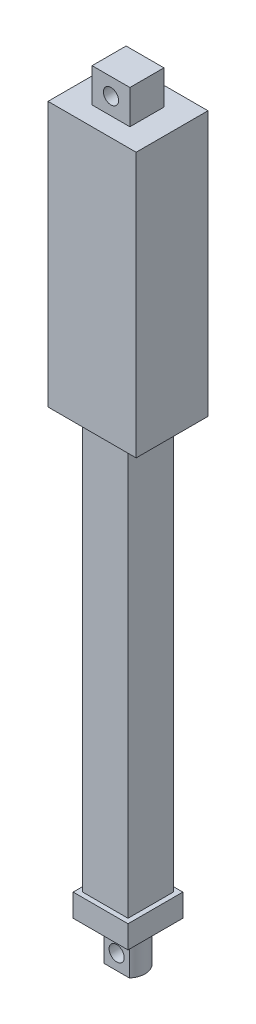
ISO-10303-21;
HEADER;
FILE_DESCRIPTION(('STEP AP214'),'2;1');
FILE_NAME('part.step','',(''),(''),'','','');
FILE_SCHEMA(('AUTOMOTIVE_DESIGN { 1 0 10303 214 1 1 1 1 }'));
ENDSEC;
DATA;
#1=APPLICATION_CONTEXT('core data for automotive mechanical design processes');
#2=APPLICATION_PROTOCOL_DEFINITION('international standard','automotive_design',2000,#1);
#3=PRODUCT_CONTEXT('',#1,'mechanical');
#4=PRODUCT('Part','Part','',(#3));
#5=PRODUCT_RELATED_PRODUCT_CATEGORY('part','',(#4));
#6=PRODUCT_DEFINITION_FORMATION('','',#4);
#7=PRODUCT_DEFINITION_CONTEXT('part definition',#1,'design');
#8=PRODUCT_DEFINITION('design','',#6,#7);
#9=PRODUCT_DEFINITION_SHAPE('','',#8);
#10=(LENGTH_UNIT() NAMED_UNIT(*) SI_UNIT(.MILLI.,.METRE.));
#11=(NAMED_UNIT(*) PLANE_ANGLE_UNIT() SI_UNIT($,.RADIAN.));
#12=(NAMED_UNIT(*) SI_UNIT($,.STERADIAN.) SOLID_ANGLE_UNIT());
#13=UNCERTAINTY_MEASURE_WITH_UNIT(LENGTH_MEASURE(1.E-05),#10,'distance_accuracy_value','');
#14=(GEOMETRIC_REPRESENTATION_CONTEXT(3) GLOBAL_UNCERTAINTY_ASSIGNED_CONTEXT((#13)) GLOBAL_UNIT_ASSIGNED_CONTEXT((#10,
#11,#12)) REPRESENTATION_CONTEXT('',''));
#15=CARTESIAN_POINT('',(0.,0.,0.));
#16=DIRECTION('',(0.,0.,1.));
#17=DIRECTION('',(1.,0.,0.));
#18=AXIS2_PLACEMENT_3D('',#15,#16,#17);
#19=CARTESIAN_POINT('',(0.,-126.5,0.));
#20=DIRECTION('',(0.,1.,0.));
#21=DIRECTION('',(0.,0.,1.));
#22=AXIS2_PLACEMENT_3D('',#19,#20,#21);
#23=CYLINDRICAL_SURFACE('',#22,4.5);
#24=CARTESIAN_POINT('',(0.,-126.5,0.));
#25=DIRECTION('',(0.,-1.,0.));
#26=DIRECTION('',(0.,0.,-1.));
#27=AXIS2_PLACEMENT_3D('',#24,#25,#26);
#28=CIRCLE('',#27,4.5);
#29=CARTESIAN_POINT('',(-3.35410196624968,-126.5,3.));
#30=VERTEX_POINT('',#29);
#31=CARTESIAN_POINT('',(-3.35410196624968,-126.5,-3.));
#32=VERTEX_POINT('',#31);
#33=EDGE_CURVE('E190',#30,#32,#28,.T.);
#34=ORIENTED_EDGE('',*,*,#33,.F.);
#35=DIRECTION('',(0.,-1.,0.));
#36=VECTOR('',#35,1.);
#37=CARTESIAN_POINT('',(-3.35410196624968,-109.126136457566,3.));
#38=LINE('',#37,#36);
#39=CARTESIAN_POINT('',(-3.35410196624968,-116.,3.));
#40=VERTEX_POINT('',#39);
#41=EDGE_CURVE('E51',#40,#30,#38,.T.);
#42=ORIENTED_EDGE('',*,*,#41,.F.);
#43=CARTESIAN_POINT('',(0.,-116.,0.));
#44=DIRECTION('',(0.,-1.,0.));
#45=DIRECTION('',(0.,0.,-1.));
#46=AXIS2_PLACEMENT_3D('',#43,#44,#45);
#47=CIRCLE('',#46,4.5);
#48=CARTESIAN_POINT('',(-3.35410196624968,-116.,-3.));
#49=VERTEX_POINT('',#48);
#50=EDGE_CURVE('E43',#40,#49,#47,.T.);
#51=ORIENTED_EDGE('',*,*,#50,.T.);
#52=DIRECTION('',(0.,-1.,0.));
#53=VECTOR('',#52,1.);
#54=CARTESIAN_POINT('',(-3.35410196624968,-109.126136457566,-3.));
#55=LINE('',#54,#53);
#56=EDGE_CURVE('E607',#49,#32,#55,.T.);
#57=ORIENTED_EDGE('',*,*,#56,.T.);
#58=EDGE_LOOP('',(#34,#42,#51,#57));
#59=FACE_BOUND('',#58,.T.);
#60=ADVANCED_FACE('F34',(#59),#23,.T.);
#61=CARTESIAN_POINT('',(3.35410196624968,-116.,-3.));
#62=VERTEX_POINT('',#61);
#63=CARTESIAN_POINT('',(3.35410196624968,-116.,3.));
#64=VERTEX_POINT('',#63);
#65=EDGE_CURVE('E11',#62,#64,#47,.T.);
#66=ORIENTED_EDGE('',*,*,#65,.T.);
#67=DIRECTION('',(0.,-1.,0.));
#68=VECTOR('',#67,1.);
#69=CARTESIAN_POINT('',(3.35410196624968,-109.126136457566,3.));
#70=LINE('',#69,#68);
#71=CARTESIAN_POINT('',(3.35410196624968,-126.5,3.));
#72=VERTEX_POINT('',#71);
#73=EDGE_CURVE('E173',#64,#72,#70,.T.);
#74=ORIENTED_EDGE('',*,*,#73,.T.);
#75=CARTESIAN_POINT('',(3.35410196624968,-126.5,-3.));
#76=VERTEX_POINT('',#75);
#77=EDGE_CURVE('E184',#76,#72,#28,.T.);
#78=ORIENTED_EDGE('',*,*,#77,.F.);
#79=DIRECTION('',(0.,-1.,0.));
#80=VECTOR('',#79,1.);
#81=CARTESIAN_POINT('',(3.35410196624968,-109.126136457566,-3.));
#82=LINE('',#81,#80);
#83=EDGE_CURVE('E59',#62,#76,#82,.T.);
#84=ORIENTED_EDGE('',*,*,#83,.F.);
#85=EDGE_LOOP('',(#66,#74,#78,#84));
#86=FACE_BOUND('',#85,.T.);
#87=ADVANCED_FACE('F183',(#86),#23,.T.);
#88=CARTESIAN_POINT('',(0.,-126.5,0.));
#89=DIRECTION('',(0.,-1.,0.));
#90=DIRECTION('',(0.,0.,-1.));
#91=AXIS2_PLACEMENT_3D('',#88,#89,#90);
#92=PLANE('',#91);
#93=DIRECTION('',(1.,0.,0.));
#94=VECTOR('',#93,1.);
#95=CARTESIAN_POINT('',(-3.35410196624968,-126.5,3.));
#96=LINE('',#95,#94);
#97=EDGE_CURVE('E170',#30,#72,#96,.T.);
#98=ORIENTED_EDGE('',*,*,#97,.F.);
#99=ORIENTED_EDGE('',*,*,#33,.T.);
#100=DIRECTION('',(1.,0.,0.));
#101=VECTOR('',#100,1.);
#102=CARTESIAN_POINT('',(-3.35410196624968,-126.5,-3.));
#103=LINE('',#102,#101);
#104=EDGE_CURVE('E179',#32,#76,#103,.T.);
#105=ORIENTED_EDGE('',*,*,#104,.T.);
#106=ORIENTED_EDGE('',*,*,#77,.T.);
#107=EDGE_LOOP('',(#98,#99,#105,#106));
#108=FACE_BOUND('',#107,.T.);
#109=ADVANCED_FACE('F188',(#108),#92,.T.);
#110=CARTESIAN_POINT('',(0.,0.,0.));
#111=DIRECTION('',(0.,1.,0.));
#112=DIRECTION('',(0.,0.,1.));
#113=AXIS2_PLACEMENT_3D('',#110,#111,#112);
#114=PLANE('',#113);
#115=DIRECTION('',(0.,0.,-1.));
#116=VECTOR('',#115,1.);
#117=CARTESIAN_POINT('',(11.65,0.,-9.5));
#118=LINE('',#117,#116);
#119=CARTESIAN_POINT('',(11.65,0.,9.5));
#120=VERTEX_POINT('',#119);
#121=CARTESIAN_POINT('',(11.65,0.,-9.5));
#122=VERTEX_POINT('',#121);
#123=EDGE_CURVE('E298',#120,#122,#118,.T.);
#124=ORIENTED_EDGE('',*,*,#123,.F.);
#125=DIRECTION('',(1.,0.,0.));
#126=VECTOR('',#125,1.);
#127=CARTESIAN_POINT('',(-11.65,0.,9.5));
#128=LINE('',#127,#126);
#129=CARTESIAN_POINT('',(-11.65,0.,9.5));
#130=VERTEX_POINT('',#129);
#131=EDGE_CURVE('E303',#130,#120,#128,.T.);
#132=ORIENTED_EDGE('',*,*,#131,.F.);
#133=DIRECTION('',(0.,0.,1.));
#134=VECTOR('',#133,1.);
#135=CARTESIAN_POINT('',(-11.65,0.,-9.5));
#136=LINE('',#135,#134);
#137=CARTESIAN_POINT('',(-11.65,0.,-9.5));
#138=VERTEX_POINT('',#137);
#139=EDGE_CURVE('E314',#138,#130,#136,.T.);
#140=ORIENTED_EDGE('',*,*,#139,.F.);
#141=DIRECTION('',(-1.,0.,0.));
#142=VECTOR('',#141,1.);
#143=CARTESIAN_POINT('',(-11.65,0.,-9.5));
#144=LINE('',#143,#142);
#145=EDGE_CURVE('E312',#122,#138,#144,.T.);
#146=ORIENTED_EDGE('',*,*,#145,.F.);
#147=EDGE_LOOP('',(#124,#132,#140,#146));
#148=FACE_BOUND('',#147,.T.);
#149=DIRECTION('',(0.,0.,1.));
#150=VECTOR('',#149,1.);
#151=CARTESIAN_POINT('',(6.,0.,6.));
#152=LINE('',#151,#150);
#153=CARTESIAN_POINT('',(6.,0.,-6.));
#154=VERTEX_POINT('',#153);
#155=CARTESIAN_POINT('',(6.,0.,6.));
#156=VERTEX_POINT('',#155);
#157=EDGE_CURVE('E225',#154,#156,#152,.T.);
#158=ORIENTED_EDGE('',*,*,#157,.F.);
#159=DIRECTION('',(1.,0.,0.));
#160=VECTOR('',#159,1.);
#161=CARTESIAN_POINT('',(-6.,0.,-6.));
#162=LINE('',#161,#160);
#163=CARTESIAN_POINT('',(-6.,0.,-6.));
#164=VERTEX_POINT('',#163);
#165=EDGE_CURVE('E230',#164,#154,#162,.T.);
#166=ORIENTED_EDGE('',*,*,#165,.F.);
#167=DIRECTION('',(0.,0.,-1.));
#168=VECTOR('',#167,1.);
#169=CARTESIAN_POINT('',(-6.,0.,6.));
#170=LINE('',#169,#168);
#171=CARTESIAN_POINT('',(-6.,0.,6.));
#172=VERTEX_POINT('',#171);
#173=EDGE_CURVE('E245',#172,#164,#170,.T.);
#174=ORIENTED_EDGE('',*,*,#173,.F.);
#175=DIRECTION('',(-1.,0.,0.));
#176=VECTOR('',#175,1.);
#177=CARTESIAN_POINT('',(-6.,0.,6.));
#178=LINE('',#177,#176);
#179=EDGE_CURVE('E242',#156,#172,#178,.T.);
#180=ORIENTED_EDGE('',*,*,#179,.F.);
#181=EDGE_LOOP('',(#158,#166,#174,#180));
#182=FACE_BOUND('',#181,.T.);
#183=ADVANCED_FACE('F421',(#148,#182),#114,.F.);
#184=CARTESIAN_POINT('',(11.65,70.,-9.5));
#185=DIRECTION('',(-1.,0.,0.));
#186=DIRECTION('',(0.,0.,1.));
#187=AXIS2_PLACEMENT_3D('',#184,#185,#186);
#188=PLANE('',#187);
#189=ORIENTED_EDGE('',*,*,#123,.T.);
#190=DIRECTION('',(0.,-1.,0.));
#191=VECTOR('',#190,1.);
#192=CARTESIAN_POINT('',(11.65,70.,-9.5));
#193=LINE('',#192,#191);
#194=CARTESIAN_POINT('',(11.65,70.,-9.5));
#195=VERTEX_POINT('',#194);
#196=EDGE_CURVE('E325',#195,#122,#193,.T.);
#197=ORIENTED_EDGE('',*,*,#196,.F.);
#198=DIRECTION('',(0.,0.,-1.));
#199=VECTOR('',#198,1.);
#200=CARTESIAN_POINT('',(11.65,70.,-9.5));
#201=LINE('',#200,#199);
#202=CARTESIAN_POINT('',(11.65,70.,9.5));
#203=VERTEX_POINT('',#202);
#204=EDGE_CURVE('E299',#203,#195,#201,.T.);
#205=ORIENTED_EDGE('',*,*,#204,.F.);
#206=DIRECTION('',(0.,-1.,0.));
#207=VECTOR('',#206,1.);
#208=CARTESIAN_POINT('',(11.65,70.,9.5));
#209=LINE('',#208,#207);
#210=EDGE_CURVE('E309',#203,#120,#209,.T.);
#211=ORIENTED_EDGE('',*,*,#210,.T.);
#212=EDGE_LOOP('',(#189,#197,#205,#211));
#213=FACE_BOUND('',#212,.T.);
#214=ADVANCED_FACE('F36',(#213),#188,.F.);
#215=CARTESIAN_POINT('',(-11.65,70.,-9.5));
#216=DIRECTION('',(0.,0.,1.));
#217=DIRECTION('',(1.,0.,0.));
#218=AXIS2_PLACEMENT_3D('',#215,#216,#217);
#219=PLANE('',#218);
#220=ORIENTED_EDGE('',*,*,#145,.T.);
#221=DIRECTION('',(0.,-1.,0.));
#222=VECTOR('',#221,1.);
#223=CARTESIAN_POINT('',(-11.65,70.,-9.5));
#224=LINE('',#223,#222);
#225=CARTESIAN_POINT('',(-11.65,70.,-9.5));
#226=VERTEX_POINT('',#225);
#227=EDGE_CURVE('E322',#226,#138,#224,.T.);
#228=ORIENTED_EDGE('',*,*,#227,.F.);
#229=DIRECTION('',(-1.,0.,0.));
#230=VECTOR('',#229,1.);
#231=CARTESIAN_POINT('',(-11.65,70.,-9.5));
#232=LINE('',#231,#230);
#233=EDGE_CURVE('E302',#195,#226,#232,.T.);
#234=ORIENTED_EDGE('',*,*,#233,.F.);
#235=ORIENTED_EDGE('',*,*,#196,.T.);
#236=EDGE_LOOP('',(#220,#228,#234,#235));
#237=FACE_BOUND('',#236,.T.);
#238=ADVANCED_FACE('F432',(#237),#219,.F.);
#239=CARTESIAN_POINT('',(-11.65,70.,-9.5));
#240=DIRECTION('',(1.,0.,0.));
#241=DIRECTION('',(0.,0.,-1.));
#242=AXIS2_PLACEMENT_3D('',#239,#240,#241);
#243=PLANE('',#242);
#244=ORIENTED_EDGE('',*,*,#139,.T.);
#245=DIRECTION('',(0.,-1.,0.));
#246=VECTOR('',#245,1.);
#247=CARTESIAN_POINT('',(-11.65,70.,9.5));
#248=LINE('',#247,#246);
#249=CARTESIAN_POINT('',(-11.65,70.,9.5));
#250=VERTEX_POINT('',#249);
#251=EDGE_CURVE('E319',#250,#130,#248,.T.);
#252=ORIENTED_EDGE('',*,*,#251,.F.);
#253=DIRECTION('',(0.,0.,1.));
#254=VECTOR('',#253,1.);
#255=CARTESIAN_POINT('',(-11.65,70.,-9.5));
#256=LINE('',#255,#254);
#257=EDGE_CURVE('E305',#226,#250,#256,.T.);
#258=ORIENTED_EDGE('',*,*,#257,.F.);
#259=ORIENTED_EDGE('',*,*,#227,.T.);
#260=EDGE_LOOP('',(#244,#252,#258,#259));
#261=FACE_BOUND('',#260,.T.);
#262=ADVANCED_FACE('F441',(#261),#243,.F.);
#263=CARTESIAN_POINT('',(-11.65,70.,9.5));
#264=DIRECTION('',(0.,0.,-1.));
#265=DIRECTION('',(-1.,0.,0.));
#266=AXIS2_PLACEMENT_3D('',#263,#264,#265);
#267=PLANE('',#266);
#268=ORIENTED_EDGE('',*,*,#131,.T.);
#269=ORIENTED_EDGE('',*,*,#210,.F.);
#270=DIRECTION('',(1.,0.,0.));
#271=VECTOR('',#270,1.);
#272=CARTESIAN_POINT('',(-11.65,70.,9.5));
#273=LINE('',#272,#271);
#274=EDGE_CURVE('E307',#250,#203,#273,.T.);
#275=ORIENTED_EDGE('',*,*,#274,.F.);
#276=ORIENTED_EDGE('',*,*,#251,.T.);
#277=EDGE_LOOP('',(#268,#269,#275,#276));
#278=FACE_BOUND('',#277,.T.);
#279=ADVANCED_FACE('F438',(#278),#267,.F.);
#280=CARTESIAN_POINT('',(0.,70.,0.));
#281=DIRECTION('',(0.,1.,0.));
#282=DIRECTION('',(0.,0.,1.));
#283=AXIS2_PLACEMENT_3D('',#280,#281,#282);
#284=PLANE('',#283);
#285=DIRECTION('',(0.,0.,-1.));
#286=VECTOR('',#285,1.);
#287=CARTESIAN_POINT('',(5.,70.,-4.5));
#288=LINE('',#287,#286);
#289=CARTESIAN_POINT('',(5.,70.,4.5));
#290=VERTEX_POINT('',#289);
#291=CARTESIAN_POINT('',(5.,70.,-4.5));
#292=VERTEX_POINT('',#291);
#293=EDGE_CURVE('E265',#290,#292,#288,.T.);
#294=ORIENTED_EDGE('',*,*,#293,.F.);
#295=DIRECTION('',(1.,0.,0.));
#296=VECTOR('',#295,1.);
#297=CARTESIAN_POINT('',(-5.,70.,4.5));
#298=LINE('',#297,#296);
#299=CARTESIAN_POINT('',(-5.,70.,4.5));
#300=VERTEX_POINT('',#299);
#301=EDGE_CURVE('E270',#300,#290,#298,.T.);
#302=ORIENTED_EDGE('',*,*,#301,.F.);
#303=DIRECTION('',(0.,0.,1.));
#304=VECTOR('',#303,1.);
#305=CARTESIAN_POINT('',(-5.,70.,-4.5));
#306=LINE('',#305,#304);
#307=CARTESIAN_POINT('',(-5.,70.,-4.5));
#308=VERTEX_POINT('',#307);
#309=EDGE_CURVE('E282',#308,#300,#306,.T.);
#310=ORIENTED_EDGE('',*,*,#309,.F.);
#311=DIRECTION('',(-1.,0.,0.));
#312=VECTOR('',#311,1.);
#313=CARTESIAN_POINT('',(-5.,70.,-4.5));
#314=LINE('',#313,#312);
#315=EDGE_CURVE('E279',#292,#308,#314,.T.);
#316=ORIENTED_EDGE('',*,*,#315,.F.);
#317=EDGE_LOOP('',(#294,#302,#310,#316));
#318=FACE_BOUND('',#317,.T.);
#319=ORIENTED_EDGE('',*,*,#204,.T.);
#320=ORIENTED_EDGE('',*,*,#233,.T.);
#321=ORIENTED_EDGE('',*,*,#257,.T.);
#322=ORIENTED_EDGE('',*,*,#274,.T.);
#323=EDGE_LOOP('',(#319,#320,#321,#322));
#324=FACE_BOUND('',#323,.T.);
#325=ADVANCED_FACE('F358',(#318,#324),#284,.T.);
#326=CARTESIAN_POINT('',(5.,79.,-4.5));
#327=DIRECTION('',(-1.,0.,0.));
#328=DIRECTION('',(0.,0.,1.));
#329=AXIS2_PLACEMENT_3D('',#326,#327,#328);
#330=PLANE('',#329);
#331=ORIENTED_EDGE('',*,*,#293,.T.);
#332=DIRECTION('',(0.,-1.,0.));
#333=VECTOR('',#332,1.);
#334=CARTESIAN_POINT('',(5.,79.,-4.5));
#335=LINE('',#334,#333);
#336=CARTESIAN_POINT('',(5.,79.,-4.5));
#337=VERTEX_POINT('',#336);
#338=EDGE_CURVE('E295',#337,#292,#335,.T.);
#339=ORIENTED_EDGE('',*,*,#338,.F.);
#340=DIRECTION('',(0.,0.,-1.));
#341=VECTOR('',#340,1.);
#342=CARTESIAN_POINT('',(5.,79.,-4.5));
#343=LINE('',#342,#341);
#344=CARTESIAN_POINT('',(5.,79.,4.5));
#345=VERTEX_POINT('',#344);
#346=EDGE_CURVE('E266',#345,#337,#343,.T.);
#347=ORIENTED_EDGE('',*,*,#346,.F.);
#348=DIRECTION('',(0.,-1.,0.));
#349=VECTOR('',#348,1.);
#350=CARTESIAN_POINT('',(5.,79.,4.5));
#351=LINE('',#350,#349);
#352=EDGE_CURVE('E276',#345,#290,#351,.T.);
#353=ORIENTED_EDGE('',*,*,#352,.T.);
#354=EDGE_LOOP('',(#331,#339,#347,#353));
#355=FACE_BOUND('',#354,.T.);
#356=ADVANCED_FACE('F345',(#355),#330,.F.);
#357=CARTESIAN_POINT('',(-5.,79.,-4.5));
#358=DIRECTION('',(0.,0.,1.));
#359=DIRECTION('',(1.,0.,0.));
#360=AXIS2_PLACEMENT_3D('',#357,#358,#359);
#361=PLANE('',#360);
#362=CARTESIAN_POINT('',(0.,74.5,-4.5));
#363=DIRECTION('',(0.,0.,1.));
#364=DIRECTION('',(1.,0.,0.));
#365=AXIS2_PLACEMENT_3D('',#362,#363,#364);
#366=CIRCLE('',#365,2.);
#367=CARTESIAN_POINT('',(2.,74.5,-4.5));
#368=VERTEX_POINT('',#367);
#369=EDGE_CURVE('E262',#368,#368,#366,.T.);
#370=ORIENTED_EDGE('',*,*,#369,.T.);
#371=EDGE_LOOP('',(#370));
#372=FACE_BOUND('',#371,.T.);
#373=ORIENTED_EDGE('',*,*,#315,.T.);
#374=DIRECTION('',(0.,-1.,0.));
#375=VECTOR('',#374,1.);
#376=CARTESIAN_POINT('',(-5.,79.,-4.5));
#377=LINE('',#376,#375);
#378=CARTESIAN_POINT('',(-5.,79.,-4.5));
#379=VERTEX_POINT('',#378);
#380=EDGE_CURVE('E292',#379,#308,#377,.T.);
#381=ORIENTED_EDGE('',*,*,#380,.F.);
#382=DIRECTION('',(-1.,0.,0.));
#383=VECTOR('',#382,1.);
#384=CARTESIAN_POINT('',(-5.,79.,-4.5));
#385=LINE('',#384,#383);
#386=EDGE_CURVE('E269',#337,#379,#385,.T.);
#387=ORIENTED_EDGE('',*,*,#386,.F.);
#388=ORIENTED_EDGE('',*,*,#338,.T.);
#389=EDGE_LOOP('',(#373,#381,#387,#388));
#390=FACE_BOUND('',#389,.T.);
#391=ADVANCED_FACE('F341',(#372,#390),#361,.F.);
#392=CARTESIAN_POINT('',(-5.,79.,-4.5));
#393=DIRECTION('',(1.,0.,0.));
#394=DIRECTION('',(0.,0.,-1.));
#395=AXIS2_PLACEMENT_3D('',#392,#393,#394);
#396=PLANE('',#395);
#397=ORIENTED_EDGE('',*,*,#309,.T.);
#398=DIRECTION('',(0.,-1.,0.));
#399=VECTOR('',#398,1.);
#400=CARTESIAN_POINT('',(-5.,79.,4.5));
#401=LINE('',#400,#399);
#402=CARTESIAN_POINT('',(-5.,79.,4.5));
#403=VERTEX_POINT('',#402);
#404=EDGE_CURVE('E289',#403,#300,#401,.T.);
#405=ORIENTED_EDGE('',*,*,#404,.F.);
#406=DIRECTION('',(0.,0.,1.));
#407=VECTOR('',#406,1.);
#408=CARTESIAN_POINT('',(-5.,79.,-4.5));
#409=LINE('',#408,#407);
#410=EDGE_CURVE('E272',#379,#403,#409,.T.);
#411=ORIENTED_EDGE('',*,*,#410,.F.);
#412=ORIENTED_EDGE('',*,*,#380,.T.);
#413=EDGE_LOOP('',(#397,#405,#411,#412));
#414=FACE_BOUND('',#413,.T.);
#415=ADVANCED_FACE('F344',(#414),#396,.F.);
#416=CARTESIAN_POINT('',(-5.,79.,4.5));
#417=DIRECTION('',(0.,0.,-1.));
#418=DIRECTION('',(-1.,0.,0.));
#419=AXIS2_PLACEMENT_3D('',#416,#417,#418);
#420=PLANE('',#419);
#421=CARTESIAN_POINT('',(0.,74.5,4.5));
#422=DIRECTION('',(0.,0.,-1.));
#423=DIRECTION('',(-1.,0.,0.));
#424=AXIS2_PLACEMENT_3D('',#421,#422,#423);
#425=CIRCLE('',#424,2.);
#426=CARTESIAN_POINT('',(-2.,74.5,4.5));
#427=VERTEX_POINT('',#426);
#428=EDGE_CURVE('E261',#427,#427,#425,.T.);
#429=ORIENTED_EDGE('',*,*,#428,.T.);
#430=EDGE_LOOP('',(#429));
#431=FACE_BOUND('',#430,.T.);
#432=ORIENTED_EDGE('',*,*,#301,.T.);
#433=ORIENTED_EDGE('',*,*,#352,.F.);
#434=DIRECTION('',(1.,0.,0.));
#435=VECTOR('',#434,1.);
#436=CARTESIAN_POINT('',(-5.,79.,4.5));
#437=LINE('',#436,#435);
#438=EDGE_CURVE('E274',#403,#345,#437,.T.);
#439=ORIENTED_EDGE('',*,*,#438,.F.);
#440=ORIENTED_EDGE('',*,*,#404,.T.);
#441=EDGE_LOOP('',(#432,#433,#439,#440));
#442=FACE_BOUND('',#441,.T.);
#443=ADVANCED_FACE('F330',(#431,#442),#420,.F.);
#444=CARTESIAN_POINT('',(0.,79.,0.));
#445=DIRECTION('',(0.,1.,0.));
#446=DIRECTION('',(0.,0.,1.));
#447=AXIS2_PLACEMENT_3D('',#444,#445,#446);
#448=PLANE('',#447);
#449=ORIENTED_EDGE('',*,*,#346,.T.);
#450=ORIENTED_EDGE('',*,*,#386,.T.);
#451=ORIENTED_EDGE('',*,*,#410,.T.);
#452=ORIENTED_EDGE('',*,*,#438,.T.);
#453=EDGE_LOOP('',(#449,#450,#451,#452));
#454=FACE_BOUND('',#453,.T.);
#455=ADVANCED_FACE('F337',(#454),#448,.T.);
#456=CARTESIAN_POINT('',(0.,74.5,-9.5));
#457=DIRECTION('',(0.,0.,1.));
#458=DIRECTION('',(1.,0.,0.));
#459=AXIS2_PLACEMENT_3D('',#456,#457,#458);
#460=CYLINDRICAL_SURFACE('',#459,2.);
#461=ORIENTED_EDGE('',*,*,#428,.F.);
#462=EDGE_LOOP('',(#461));
#463=FACE_BOUND('',#462,.T.);
#464=ORIENTED_EDGE('',*,*,#369,.F.);
#465=EDGE_LOOP('',(#464));
#466=FACE_BOUND('',#465,.T.);
#467=ADVANCED_FACE('F333',(#463,#466),#460,.F.);
#468=CARTESIAN_POINT('',(6.,-110.,6.));
#469=DIRECTION('',(-1.,0.,0.));
#470=DIRECTION('',(0.,0.,1.));
#471=AXIS2_PLACEMENT_3D('',#468,#469,#470);
#472=PLANE('',#471);
#473=ORIENTED_EDGE('',*,*,#157,.T.);
#474=DIRECTION('',(0.,1.,0.));
#475=VECTOR('',#474,1.);
#476=CARTESIAN_POINT('',(6.,-110.,6.));
#477=LINE('',#476,#475);
#478=CARTESIAN_POINT('',(6.,-110.,6.));
#479=VERTEX_POINT('',#478);
#480=EDGE_CURVE('E258',#479,#156,#477,.T.);
#481=ORIENTED_EDGE('',*,*,#480,.F.);
#482=DIRECTION('',(0.,0.,1.));
#483=VECTOR('',#482,1.);
#484=CARTESIAN_POINT('',(6.,-110.,6.));
#485=LINE('',#484,#483);
#486=CARTESIAN_POINT('',(6.,-110.,-6.));
#487=VERTEX_POINT('',#486);
#488=EDGE_CURVE('E226',#487,#479,#485,.T.);
#489=ORIENTED_EDGE('',*,*,#488,.F.);
#490=DIRECTION('',(0.,1.,0.));
#491=VECTOR('',#490,1.);
#492=CARTESIAN_POINT('',(6.,-110.,-6.));
#493=LINE('',#492,#491);
#494=EDGE_CURVE('E239',#487,#154,#493,.T.);
#495=ORIENTED_EDGE('',*,*,#494,.T.);
#496=EDGE_LOOP('',(#473,#481,#489,#495));
#497=FACE_BOUND('',#496,.T.);
#498=ADVANCED_FACE('F336',(#497),#472,.F.);
#499=CARTESIAN_POINT('',(-6.,-110.,6.));
#500=DIRECTION('',(0.,0.,-1.));
#501=DIRECTION('',(-1.,0.,0.));
#502=AXIS2_PLACEMENT_3D('',#499,#500,#501);
#503=PLANE('',#502);
#504=ORIENTED_EDGE('',*,*,#179,.T.);
#505=DIRECTION('',(0.,1.,0.));
#506=VECTOR('',#505,1.);
#507=CARTESIAN_POINT('',(-6.,-110.,6.));
#508=LINE('',#507,#506);
#509=CARTESIAN_POINT('',(-6.,-110.,6.));
#510=VERTEX_POINT('',#509);
#511=EDGE_CURVE('E255',#510,#172,#508,.T.);
#512=ORIENTED_EDGE('',*,*,#511,.F.);
#513=DIRECTION('',(-1.,0.,0.));
#514=VECTOR('',#513,1.);
#515=CARTESIAN_POINT('',(-6.,-110.,6.));
#516=LINE('',#515,#514);
#517=EDGE_CURVE('E229',#479,#510,#516,.T.);
#518=ORIENTED_EDGE('',*,*,#517,.F.);
#519=ORIENTED_EDGE('',*,*,#480,.T.);
#520=EDGE_LOOP('',(#504,#512,#518,#519));
#521=FACE_BOUND('',#520,.T.);
#522=ADVANCED_FACE('F409',(#521),#503,.F.);
#523=CARTESIAN_POINT('',(-6.,-110.,6.));
#524=DIRECTION('',(1.,0.,0.));
#525=DIRECTION('',(0.,0.,-1.));
#526=AXIS2_PLACEMENT_3D('',#523,#524,#525);
#527=PLANE('',#526);
#528=ORIENTED_EDGE('',*,*,#173,.T.);
#529=DIRECTION('',(0.,1.,0.));
#530=VECTOR('',#529,1.);
#531=CARTESIAN_POINT('',(-6.,-110.,-6.));
#532=LINE('',#531,#530);
#533=CARTESIAN_POINT('',(-6.,-110.,-6.));
#534=VERTEX_POINT('',#533);
#535=EDGE_CURVE('E252',#534,#164,#532,.T.);
#536=ORIENTED_EDGE('',*,*,#535,.F.);
#537=DIRECTION('',(0.,0.,-1.));
#538=VECTOR('',#537,1.);
#539=CARTESIAN_POINT('',(-6.,-110.,6.));
#540=LINE('',#539,#538);
#541=EDGE_CURVE('E233',#510,#534,#540,.T.);
#542=ORIENTED_EDGE('',*,*,#541,.F.);
#543=ORIENTED_EDGE('',*,*,#511,.T.);
#544=EDGE_LOOP('',(#528,#536,#542,#543));
#545=FACE_BOUND('',#544,.T.);
#546=ADVANCED_FACE('F405',(#545),#527,.F.);
#547=CARTESIAN_POINT('',(-6.,-110.,-6.));
#548=DIRECTION('',(0.,0.,1.));
#549=DIRECTION('',(1.,0.,0.));
#550=AXIS2_PLACEMENT_3D('',#547,#548,#549);
#551=PLANE('',#550);
#552=ORIENTED_EDGE('',*,*,#165,.T.);
#553=ORIENTED_EDGE('',*,*,#494,.F.);
#554=DIRECTION('',(1.,0.,0.));
#555=VECTOR('',#554,1.);
#556=CARTESIAN_POINT('',(-6.,-110.,-6.));
#557=LINE('',#556,#555);
#558=EDGE_CURVE('E236',#534,#487,#557,.T.);
#559=ORIENTED_EDGE('',*,*,#558,.F.);
#560=ORIENTED_EDGE('',*,*,#535,.T.);
#561=EDGE_LOOP('',(#552,#553,#559,#560));
#562=FACE_BOUND('',#561,.T.);
#563=ADVANCED_FACE('F387',(#562),#551,.F.);
#564=CARTESIAN_POINT('',(0.,-110.,0.));
#565=DIRECTION('',(0.,-1.,0.));
#566=DIRECTION('',(0.,0.,-1.));
#567=AXIS2_PLACEMENT_3D('',#564,#565,#566);
#568=PLANE('',#567);
#569=DIRECTION('',(0.,0.,1.));
#570=VECTOR('',#569,1.);
#571=CARTESIAN_POINT('',(7.25,-110.,7.25));
#572=LINE('',#571,#570);
#573=CARTESIAN_POINT('',(7.25,-110.,-7.25));
#574=VERTEX_POINT('',#573);
#575=CARTESIAN_POINT('',(7.25,-110.,7.25));
#576=VERTEX_POINT('',#575);
#577=EDGE_CURVE('E189',#574,#576,#572,.T.);
#578=ORIENTED_EDGE('',*,*,#577,.F.);
#579=DIRECTION('',(1.,0.,0.));
#580=VECTOR('',#579,1.);
#581=CARTESIAN_POINT('',(-7.25,-110.,-7.25));
#582=LINE('',#581,#580);
#583=CARTESIAN_POINT('',(-7.25,-110.,-7.25));
#584=VERTEX_POINT('',#583);
#585=EDGE_CURVE('E203',#584,#574,#582,.T.);
#586=ORIENTED_EDGE('',*,*,#585,.F.);
#587=DIRECTION('',(0.,0.,-1.));
#588=VECTOR('',#587,1.);
#589=CARTESIAN_POINT('',(-7.25,-110.,7.25));
#590=LINE('',#589,#588);
#591=CARTESIAN_POINT('',(-7.25,-110.,7.25));
#592=VERTEX_POINT('',#591);
#593=EDGE_CURVE('E211',#592,#584,#590,.T.);
#594=ORIENTED_EDGE('',*,*,#593,.F.);
#595=DIRECTION('',(-1.,0.,0.));
#596=VECTOR('',#595,1.);
#597=CARTESIAN_POINT('',(-7.25,-110.,7.25));
#598=LINE('',#597,#596);
#599=EDGE_CURVE('E193',#576,#592,#598,.T.);
#600=ORIENTED_EDGE('',*,*,#599,.F.);
#601=EDGE_LOOP('',(#578,#586,#594,#600));
#602=FACE_BOUND('',#601,.T.);
#603=ORIENTED_EDGE('',*,*,#558,.T.);
#604=ORIENTED_EDGE('',*,*,#488,.T.);
#605=ORIENTED_EDGE('',*,*,#517,.T.);
#606=ORIENTED_EDGE('',*,*,#541,.T.);
#607=EDGE_LOOP('',(#603,#604,#605,#606));
#608=FACE_BOUND('',#607,.T.);
#609=ADVANCED_FACE('F383',(#602,#608),#568,.F.);
#610=CARTESIAN_POINT('',(7.25,-116.,7.25));
#611=DIRECTION('',(-1.,0.,0.));
#612=DIRECTION('',(0.,0.,1.));
#613=AXIS2_PLACEMENT_3D('',#610,#611,#612);
#614=PLANE('',#613);
#615=ORIENTED_EDGE('',*,*,#577,.T.);
#616=DIRECTION('',(0.,1.,0.));
#617=VECTOR('',#616,1.);
#618=CARTESIAN_POINT('',(7.25,-116.,7.25));
#619=LINE('',#618,#617);
#620=CARTESIAN_POINT('',(7.25,-116.,7.25));
#621=VERTEX_POINT('',#620);
#622=EDGE_CURVE('E222',#621,#576,#619,.T.);
#623=ORIENTED_EDGE('',*,*,#622,.F.);
#624=DIRECTION('',(0.,0.,1.));
#625=VECTOR('',#624,1.);
#626=CARTESIAN_POINT('',(7.25,-116.,7.25));
#627=LINE('',#626,#625);
#628=CARTESIAN_POINT('',(7.25,-116.,-7.25));
#629=VERTEX_POINT('',#628);
#630=EDGE_CURVE('E199',#629,#621,#627,.T.);
#631=ORIENTED_EDGE('',*,*,#630,.F.);
#632=DIRECTION('',(0.,1.,0.));
#633=VECTOR('',#632,1.);
#634=CARTESIAN_POINT('',(7.25,-116.,-7.25));
#635=LINE('',#634,#633);
#636=EDGE_CURVE('E208',#629,#574,#635,.T.);
#637=ORIENTED_EDGE('',*,*,#636,.T.);
#638=EDGE_LOOP('',(#615,#623,#631,#637));
#639=FACE_BOUND('',#638,.T.);
#640=ADVANCED_FACE('F386',(#639),#614,.F.);
#641=CARTESIAN_POINT('',(-7.25,-116.,7.25));
#642=DIRECTION('',(0.,0.,-1.));
#643=DIRECTION('',(-1.,0.,0.));
#644=AXIS2_PLACEMENT_3D('',#641,#642,#643);
#645=PLANE('',#644);
#646=ORIENTED_EDGE('',*,*,#599,.T.);
#647=DIRECTION('',(0.,1.,0.));
#648=VECTOR('',#647,1.);
#649=CARTESIAN_POINT('',(-7.25,-116.,7.25));
#650=LINE('',#649,#648);
#651=CARTESIAN_POINT('',(-7.25,-116.,7.25));
#652=VERTEX_POINT('',#651);
#653=EDGE_CURVE('E219',#652,#592,#650,.T.);
#654=ORIENTED_EDGE('',*,*,#653,.F.);
#655=DIRECTION('',(-1.,0.,0.));
#656=VECTOR('',#655,1.);
#657=CARTESIAN_POINT('',(-7.25,-116.,7.25));
#658=LINE('',#657,#656);
#659=EDGE_CURVE('E202',#621,#652,#658,.T.);
#660=ORIENTED_EDGE('',*,*,#659,.F.);
#661=ORIENTED_EDGE('',*,*,#622,.T.);
#662=EDGE_LOOP('',(#646,#654,#660,#661));
#663=FACE_BOUND('',#662,.T.);
#664=ADVANCED_FACE('F395',(#663),#645,.F.);
#665=CARTESIAN_POINT('',(-7.25,-116.,7.25));
#666=DIRECTION('',(1.,0.,0.));
#667=DIRECTION('',(0.,0.,-1.));
#668=AXIS2_PLACEMENT_3D('',#665,#666,#667);
#669=PLANE('',#668);
#670=ORIENTED_EDGE('',*,*,#593,.T.);
#671=DIRECTION('',(0.,1.,0.));
#672=VECTOR('',#671,1.);
#673=CARTESIAN_POINT('',(-7.25,-116.,-7.25));
#674=LINE('',#673,#672);
#675=CARTESIAN_POINT('',(-7.25,-116.,-7.25));
#676=VERTEX_POINT('',#675);
#677=EDGE_CURVE('E216',#676,#584,#674,.T.);
#678=ORIENTED_EDGE('',*,*,#677,.F.);
#679=DIRECTION('',(0.,0.,-1.));
#680=VECTOR('',#679,1.);
#681=CARTESIAN_POINT('',(-7.25,-116.,7.25));
#682=LINE('',#681,#680);
#683=EDGE_CURVE('E205',#652,#676,#682,.T.);
#684=ORIENTED_EDGE('',*,*,#683,.F.);
#685=ORIENTED_EDGE('',*,*,#653,.T.);
#686=EDGE_LOOP('',(#670,#678,#684,#685));
#687=FACE_BOUND('',#686,.T.);
#688=ADVANCED_FACE('F391',(#687),#669,.F.);
#689=CARTESIAN_POINT('',(-7.25,-116.,-7.25));
#690=DIRECTION('',(0.,0.,1.));
#691=DIRECTION('',(1.,0.,0.));
#692=AXIS2_PLACEMENT_3D('',#689,#690,#691);
#693=PLANE('',#692);
#694=ORIENTED_EDGE('',*,*,#585,.T.);
#695=ORIENTED_EDGE('',*,*,#636,.F.);
#696=DIRECTION('',(1.,0.,0.));
#697=VECTOR('',#696,1.);
#698=CARTESIAN_POINT('',(-7.25,-116.,-7.25));
#699=LINE('',#698,#697);
#700=EDGE_CURVE('E207',#676,#629,#699,.T.);
#701=ORIENTED_EDGE('',*,*,#700,.F.);
#702=ORIENTED_EDGE('',*,*,#677,.T.);
#703=EDGE_LOOP('',(#694,#695,#701,#702));
#704=FACE_BOUND('',#703,.T.);
#705=ADVANCED_FACE('F381',(#704),#693,.F.);
#706=CARTESIAN_POINT('',(0.,-116.,0.));
#707=DIRECTION('',(0.,-1.,0.));
#708=DIRECTION('',(0.,0.,-1.));
#709=AXIS2_PLACEMENT_3D('',#706,#707,#708);
#710=PLANE('',#709);
#711=ORIENTED_EDGE('',*,*,#65,.F.);
#712=DIRECTION('',(-1.,0.,0.));
#713=VECTOR('',#712,1.);
#714=CARTESIAN_POINT('',(-3.35410196624968,-116.,-3.));
#715=LINE('',#714,#713);
#716=EDGE_CURVE('E196',#62,#49,#715,.T.);
#717=ORIENTED_EDGE('',*,*,#716,.T.);
#718=ORIENTED_EDGE('',*,*,#50,.F.);
#719=DIRECTION('',(-1.,0.,0.));
#720=VECTOR('',#719,1.);
#721=CARTESIAN_POINT('',(-3.35410196624968,-116.,3.));
#722=LINE('',#721,#720);
#723=EDGE_CURVE('E186',#64,#40,#722,.T.);
#724=ORIENTED_EDGE('',*,*,#723,.F.);
#725=EDGE_LOOP('',(#711,#717,#718,#724));
#726=FACE_BOUND('',#725,.T.);
#727=ORIENTED_EDGE('',*,*,#630,.T.);
#728=ORIENTED_EDGE('',*,*,#659,.T.);
#729=ORIENTED_EDGE('',*,*,#683,.T.);
#730=ORIENTED_EDGE('',*,*,#700,.T.);
#731=EDGE_LOOP('',(#727,#728,#729,#730));
#732=FACE_BOUND('',#731,.T.);
#733=ADVANCED_FACE('F377',(#726,#732),#710,.T.);
#734=CARTESIAN_POINT('',(-3.35410196624968,-109.126136457566,-3.));
#735=DIRECTION('',(0.,0.,-1.));
#736=DIRECTION('',(-1.,0.,0.));
#737=AXIS2_PLACEMENT_3D('',#734,#735,#736);
#738=PLANE('',#737);
#739=CARTESIAN_POINT('',(0.,-122.5,-3.));
#740=DIRECTION('',(0.,0.,-1.));
#741=DIRECTION('',(-1.,0.,0.));
#742=AXIS2_PLACEMENT_3D('',#739,#740,#741);
#743=CIRCLE('',#742,2.);
#744=CARTESIAN_POINT('',(-2.,-122.5,-3.));
#745=VERTEX_POINT('',#744);
#746=EDGE_CURVE('E599',#745,#745,#743,.T.);
#747=ORIENTED_EDGE('',*,*,#746,.F.);
#748=EDGE_LOOP('',(#747));
#749=FACE_BOUND('',#748,.T.);
#750=ORIENTED_EDGE('',*,*,#83,.T.);
#751=ORIENTED_EDGE('',*,*,#104,.F.);
#752=ORIENTED_EDGE('',*,*,#56,.F.);
#753=ORIENTED_EDGE('',*,*,#716,.F.);
#754=EDGE_LOOP('',(#750,#751,#752,#753));
#755=FACE_BOUND('',#754,.T.);
#756=ADVANCED_FACE('F380',(#749,#755),#738,.T.);
#757=CARTESIAN_POINT('',(-3.35410196624968,-109.126136457566,3.));
#758=DIRECTION('',(0.,0.,-1.));
#759=DIRECTION('',(-1.,0.,0.));
#760=AXIS2_PLACEMENT_3D('',#757,#758,#759);
#761=PLANE('',#760);
#762=CARTESIAN_POINT('',(0.,-122.5,3.));
#763=DIRECTION('',(0.,0.,-1.));
#764=DIRECTION('',(-1.,0.,0.));
#765=AXIS2_PLACEMENT_3D('',#762,#763,#764);
#766=CIRCLE('',#765,2.);
#767=CARTESIAN_POINT('',(-2.,-122.5,3.));
#768=VERTEX_POINT('',#767);
#769=EDGE_CURVE('E38',#768,#768,#766,.T.);
#770=ORIENTED_EDGE('',*,*,#769,.T.);
#771=EDGE_LOOP('',(#770));
#772=FACE_BOUND('',#771,.T.);
#773=ORIENTED_EDGE('',*,*,#723,.T.);
#774=ORIENTED_EDGE('',*,*,#41,.T.);
#775=ORIENTED_EDGE('',*,*,#97,.T.);
#776=ORIENTED_EDGE('',*,*,#73,.F.);
#777=EDGE_LOOP('',(#773,#774,#775,#776));
#778=FACE_BOUND('',#777,.T.);
#779=ADVANCED_FACE('F172',(#772,#778),#761,.F.);
#780=CARTESIAN_POINT('',(0.,-122.5,9.5));
#781=DIRECTION('',(0.,0.,-1.));
#782=DIRECTION('',(-1.,0.,0.));
#783=AXIS2_PLACEMENT_3D('',#780,#781,#782);
#784=CYLINDRICAL_SURFACE('',#783,2.);
#785=ORIENTED_EDGE('',*,*,#746,.T.);
#786=EDGE_LOOP('',(#785));
#787=FACE_BOUND('',#786,.T.);
#788=ORIENTED_EDGE('',*,*,#769,.F.);
#789=EDGE_LOOP('',(#788));
#790=FACE_BOUND('',#789,.T.);
#791=ADVANCED_FACE('F582',(#787,#790),#784,.F.);
#792=CLOSED_SHELL('',(#60,#87,#109,#183,#214,#238,#262,#279,#325,#356,#391,#415,#443,#455,#467,
#498,#522,#546,#563,#609,#640,#664,#688,#705,#733,#756,#779,#791));
#793=MANIFOLD_SOLID_BREP('B2',#792);
#794=ADVANCED_BREP_SHAPE_REPRESENTATION('',(#18,#793),#14);
#795=SHAPE_DEFINITION_REPRESENTATION(#9,#794);
ENDSEC;
END-ISO-10303-21;
